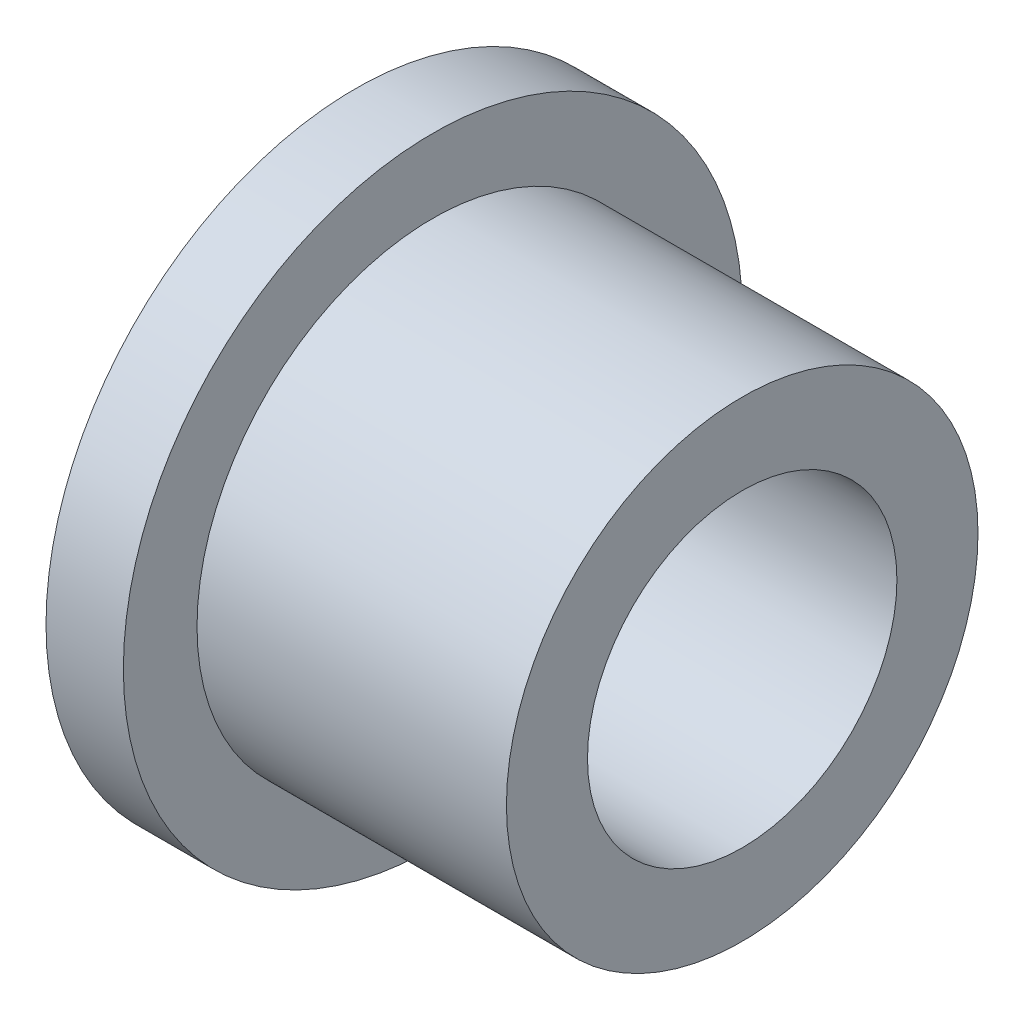
ISO-10303-21;
HEADER;
FILE_DESCRIPTION(('STEP AP214'),'2;1');
FILE_NAME('part.step','',(''),(''),'','','');
FILE_SCHEMA(('AUTOMOTIVE_DESIGN { 1 0 10303 214 1 1 1 1 }'));
ENDSEC;
DATA;
#1=APPLICATION_CONTEXT('core data for automotive mechanical design processes');
#2=APPLICATION_PROTOCOL_DEFINITION('international standard','automotive_design',2000,#1);
#3=PRODUCT_CONTEXT('',#1,'mechanical');
#4=PRODUCT('Part','Part','',(#3));
#5=PRODUCT_RELATED_PRODUCT_CATEGORY('part','',(#4));
#6=PRODUCT_DEFINITION_FORMATION('','',#4);
#7=PRODUCT_DEFINITION_CONTEXT('part definition',#1,'design');
#8=PRODUCT_DEFINITION('design','',#6,#7);
#9=PRODUCT_DEFINITION_SHAPE('','',#8);
#10=(LENGTH_UNIT() NAMED_UNIT(*) SI_UNIT(.MILLI.,.METRE.));
#11=(NAMED_UNIT(*) PLANE_ANGLE_UNIT() SI_UNIT($,.RADIAN.));
#12=(NAMED_UNIT(*) SI_UNIT($,.STERADIAN.) SOLID_ANGLE_UNIT());
#13=UNCERTAINTY_MEASURE_WITH_UNIT(LENGTH_MEASURE(1.E-05),#10,'distance_accuracy_value','');
#14=(GEOMETRIC_REPRESENTATION_CONTEXT(3) GLOBAL_UNCERTAINTY_ASSIGNED_CONTEXT((#13)) GLOBAL_UNIT_ASSIGNED_CONTEXT((#10,
#11,#12)) REPRESENTATION_CONTEXT('',''));
#15=CARTESIAN_POINT('',(0.,0.,0.));
#16=DIRECTION('',(0.,0.,1.));
#17=DIRECTION('',(1.,0.,0.));
#18=AXIS2_PLACEMENT_3D('',#15,#16,#17);
#19=CARTESIAN_POINT('',(1.5875,0.,0.));
#20=DIRECTION('',(1.,0.,0.));
#21=DIRECTION('',(0.,0.,-1.));
#22=AXIS2_PLACEMENT_3D('',#19,#20,#21);
#23=PLANE('',#22);
#24=CARTESIAN_POINT('',(1.5875,0.,0.));
#25=DIRECTION('',(1.,0.,0.));
#26=DIRECTION('',(0.,0.,-1.));
#27=AXIS2_PLACEMENT_3D('',#24,#25,#26);
#28=CIRCLE('',#27,6.35);
#29=CARTESIAN_POINT('',(1.5875,0.,-6.35));
#30=VERTEX_POINT('',#29);
#31=EDGE_CURVE('E10',#30,#30,#28,.T.);
#32=ORIENTED_EDGE('',*,*,#31,.T.);
#33=EDGE_LOOP('',(#32));
#34=FACE_BOUND('',#33,.T.);
#35=CARTESIAN_POINT('',(1.5875,0.,0.));
#36=DIRECTION('',(1.,0.,0.));
#37=DIRECTION('',(0.,0.,-1.));
#38=AXIS2_PLACEMENT_3D('',#35,#36,#37);
#39=CIRCLE('',#38,4.8387);
#40=CARTESIAN_POINT('',(1.5875,0.,-4.8387));
#41=VERTEX_POINT('',#40);
#42=EDGE_CURVE('E51',#41,#41,#39,.T.);
#43=ORIENTED_EDGE('',*,*,#42,.F.);
#44=EDGE_LOOP('',(#43));
#45=FACE_BOUND('',#44,.T.);
#46=ADVANCED_FACE('F35',(#34,#45),#23,.T.);
#47=CARTESIAN_POINT('',(0.,0.,0.));
#48=DIRECTION('',(1.,0.,0.));
#49=DIRECTION('',(0.,0.,-1.));
#50=AXIS2_PLACEMENT_3D('',#47,#48,#49);
#51=PLANE('',#50);
#52=CARTESIAN_POINT('',(0.,0.,0.));
#53=DIRECTION('',(1.,0.,0.));
#54=DIRECTION('',(0.,0.,-1.));
#55=AXIS2_PLACEMENT_3D('',#52,#53,#54);
#56=CIRCLE('',#55,6.35);
#57=CARTESIAN_POINT('',(0.,0.,-6.35));
#58=VERTEX_POINT('',#57);
#59=EDGE_CURVE('E39',#58,#58,#56,.T.);
#60=ORIENTED_EDGE('',*,*,#59,.F.);
#61=EDGE_LOOP('',(#60));
#62=FACE_BOUND('',#61,.T.);
#63=CARTESIAN_POINT('',(0.,0.,0.));
#64=DIRECTION('',(1.,0.,0.));
#65=DIRECTION('',(0.,0.,-1.));
#66=AXIS2_PLACEMENT_3D('',#63,#64,#65);
#67=CIRCLE('',#66,3.175);
#68=CARTESIAN_POINT('',(0.,0.,-3.175));
#69=VERTEX_POINT('',#68);
#70=EDGE_CURVE('E46',#69,#69,#67,.T.);
#71=ORIENTED_EDGE('',*,*,#70,.T.);
#72=EDGE_LOOP('',(#71));
#73=FACE_BOUND('',#72,.T.);
#74=ADVANCED_FACE('F76',(#62,#73),#51,.F.);
#75=CARTESIAN_POINT('',(1.5875,0.,0.));
#76=DIRECTION('',(-1.,0.,0.));
#77=DIRECTION('',(0.,0.,1.));
#78=AXIS2_PLACEMENT_3D('',#75,#76,#77);
#79=CYLINDRICAL_SURFACE('',#78,6.35);
#80=ORIENTED_EDGE('',*,*,#31,.F.);
#81=EDGE_LOOP('',(#80));
#82=FACE_BOUND('',#81,.T.);
#83=ORIENTED_EDGE('',*,*,#59,.T.);
#84=EDGE_LOOP('',(#83));
#85=FACE_BOUND('',#84,.T.);
#86=ADVANCED_FACE('F37',(#82,#85),#79,.T.);
#87=CARTESIAN_POINT('',(1.5875,0.,0.));
#88=DIRECTION('',(-1.,0.,0.));
#89=DIRECTION('',(0.,0.,1.));
#90=AXIS2_PLACEMENT_3D('',#87,#88,#89);
#91=CYLINDRICAL_SURFACE('',#90,3.175);
#92=ORIENTED_EDGE('',*,*,#70,.F.);
#93=EDGE_LOOP('',(#92));
#94=FACE_BOUND('',#93,.T.);
#95=CARTESIAN_POINT('',(7.9375,0.,0.));
#96=DIRECTION('',(1.,0.,0.));
#97=DIRECTION('',(0.,0.,-1.));
#98=AXIS2_PLACEMENT_3D('',#95,#96,#97);
#99=CIRCLE('',#98,3.175);
#100=CARTESIAN_POINT('',(7.9375,0.,-3.175));
#101=VERTEX_POINT('',#100);
#102=EDGE_CURVE('E54',#101,#101,#99,.T.);
#103=ORIENTED_EDGE('',*,*,#102,.T.);
#104=EDGE_LOOP('',(#103));
#105=FACE_BOUND('',#104,.T.);
#106=ADVANCED_FACE('F60',(#94,#105),#91,.F.);
#107=CARTESIAN_POINT('',(7.9375,0.,0.));
#108=DIRECTION('',(1.,0.,0.));
#109=DIRECTION('',(0.,0.,-1.));
#110=AXIS2_PLACEMENT_3D('',#107,#108,#109);
#111=PLANE('',#110);
#112=CARTESIAN_POINT('',(7.9375,0.,0.));
#113=DIRECTION('',(1.,0.,0.));
#114=DIRECTION('',(0.,0.,-1.));
#115=AXIS2_PLACEMENT_3D('',#112,#113,#114);
#116=CIRCLE('',#115,4.8387);
#117=CARTESIAN_POINT('',(7.9375,0.,-4.8387));
#118=VERTEX_POINT('',#117);
#119=EDGE_CURVE('E50',#118,#118,#116,.T.);
#120=ORIENTED_EDGE('',*,*,#119,.T.);
#121=EDGE_LOOP('',(#120));
#122=FACE_BOUND('',#121,.T.);
#123=ORIENTED_EDGE('',*,*,#102,.F.);
#124=EDGE_LOOP('',(#123));
#125=FACE_BOUND('',#124,.T.);
#126=ADVANCED_FACE('F62',(#122,#125),#111,.T.);
#127=CARTESIAN_POINT('',(7.9375,0.,0.));
#128=DIRECTION('',(-1.,0.,0.));
#129=DIRECTION('',(0.,0.,1.));
#130=AXIS2_PLACEMENT_3D('',#127,#128,#129);
#131=CYLINDRICAL_SURFACE('',#130,4.8387);
#132=ORIENTED_EDGE('',*,*,#119,.F.);
#133=EDGE_LOOP('',(#132));
#134=FACE_BOUND('',#133,.T.);
#135=ORIENTED_EDGE('',*,*,#42,.T.);
#136=EDGE_LOOP('',(#135));
#137=FACE_BOUND('',#136,.T.);
#138=ADVANCED_FACE('F64',(#134,#137),#131,.T.);
#139=CLOSED_SHELL('',(#46,#74,#86,#106,#126,#138));
#140=MANIFOLD_SOLID_BREP('B2',#139);
#141=ADVANCED_BREP_SHAPE_REPRESENTATION('',(#18,#140),#14);
#142=SHAPE_DEFINITION_REPRESENTATION(#9,#141);
ENDSEC;
END-ISO-10303-21;
